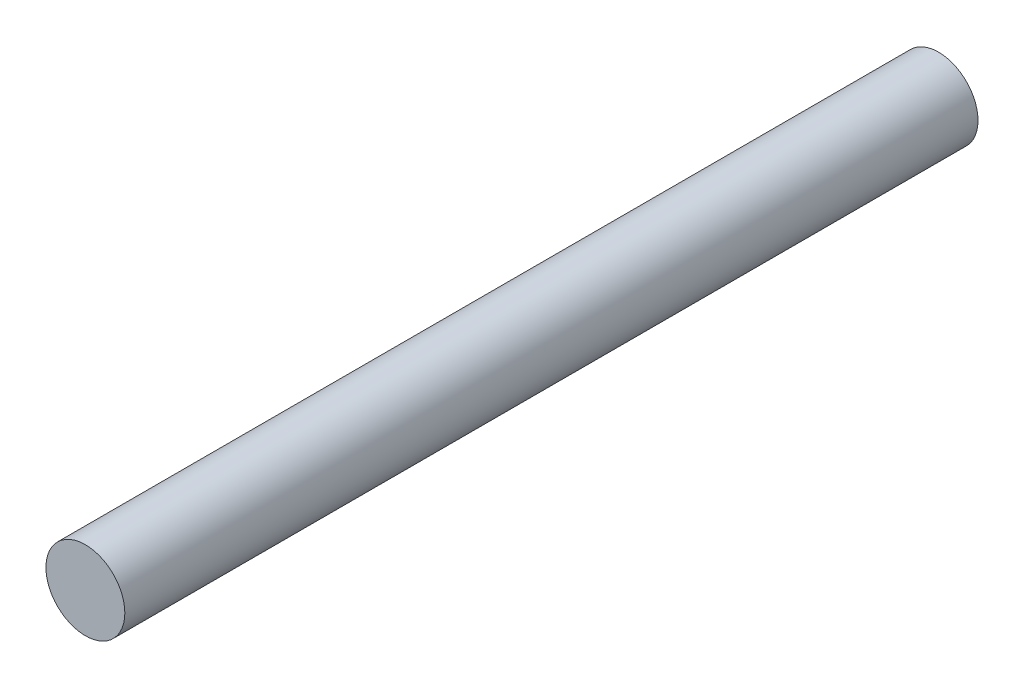
ISO-10303-21;
HEADER;
FILE_DESCRIPTION(('STEP AP214'),'2;1');
FILE_NAME('part.step','',(''),(''),'','','');
FILE_SCHEMA(('AUTOMOTIVE_DESIGN { 1 0 10303 214 1 1 1 1 }'));
ENDSEC;
DATA;
#1=APPLICATION_CONTEXT('core data for automotive mechanical design processes');
#2=APPLICATION_PROTOCOL_DEFINITION('international standard','automotive_design',2000,#1);
#3=PRODUCT_CONTEXT('',#1,'mechanical');
#4=PRODUCT('Part','Part','',(#3));
#5=PRODUCT_RELATED_PRODUCT_CATEGORY('part','',(#4));
#6=PRODUCT_DEFINITION_FORMATION('','',#4);
#7=PRODUCT_DEFINITION_CONTEXT('part definition',#1,'design');
#8=PRODUCT_DEFINITION('design','',#6,#7);
#9=PRODUCT_DEFINITION_SHAPE('','',#8);
#10=(LENGTH_UNIT() NAMED_UNIT(*) SI_UNIT(.MILLI.,.METRE.));
#11=(NAMED_UNIT(*) PLANE_ANGLE_UNIT() SI_UNIT($,.RADIAN.));
#12=(NAMED_UNIT(*) SI_UNIT($,.STERADIAN.) SOLID_ANGLE_UNIT());
#13=UNCERTAINTY_MEASURE_WITH_UNIT(LENGTH_MEASURE(1.E-05),#10,'distance_accuracy_value','');
#14=(GEOMETRIC_REPRESENTATION_CONTEXT(3) GLOBAL_UNCERTAINTY_ASSIGNED_CONTEXT((#13)) GLOBAL_UNIT_ASSIGNED_CONTEXT((#10,
#11,#12)) REPRESENTATION_CONTEXT('',''));
#15=CARTESIAN_POINT('',(0.,0.,0.));
#16=DIRECTION('',(0.,0.,1.));
#17=DIRECTION('',(1.,0.,0.));
#18=AXIS2_PLACEMENT_3D('',#15,#16,#17);
#19=CARTESIAN_POINT('',(0.,0.,100.));
#20=DIRECTION('',(0.,0.,-1.));
#21=DIRECTION('',(-1.,0.,0.));
#22=AXIS2_PLACEMENT_3D('',#19,#20,#21);
#23=CYLINDRICAL_SURFACE('',#22,4.62481396325382);
#24=CARTESIAN_POINT('',(0.,0.,100.));
#25=DIRECTION('',(0.,0.,1.));
#26=DIRECTION('',(1.,0.,0.));
#27=AXIS2_PLACEMENT_3D('',#24,#25,#26);
#28=CIRCLE('',#27,4.62481396325382);
#29=CARTESIAN_POINT('',(4.62481396325382,0.,100.));
#30=VERTEX_POINT('',#29);
#31=EDGE_CURVE('E10',#30,#30,#28,.T.);
#32=ORIENTED_EDGE('',*,*,#31,.F.);
#33=EDGE_LOOP('',(#32));
#34=FACE_BOUND('',#33,.T.);
#35=CARTESIAN_POINT('',(0.,0.,0.));
#36=DIRECTION('',(0.,0.,1.));
#37=DIRECTION('',(1.,0.,0.));
#38=AXIS2_PLACEMENT_3D('',#35,#36,#37);
#39=CIRCLE('',#38,4.62481396325382);
#40=CARTESIAN_POINT('',(4.62481396325382,0.,0.));
#41=VERTEX_POINT('',#40);
#42=EDGE_CURVE('E40',#41,#41,#39,.T.);
#43=ORIENTED_EDGE('',*,*,#42,.T.);
#44=EDGE_LOOP('',(#43));
#45=FACE_BOUND('',#44,.T.);
#46=ADVANCED_FACE('F37',(#34,#45),#23,.T.);
#47=CARTESIAN_POINT('',(0.,0.,100.));
#48=DIRECTION('',(0.,0.,1.));
#49=DIRECTION('',(1.,0.,0.));
#50=AXIS2_PLACEMENT_3D('',#47,#48,#49);
#51=PLANE('',#50);
#52=ORIENTED_EDGE('',*,*,#31,.T.);
#53=EDGE_LOOP('',(#52));
#54=FACE_BOUND('',#53,.T.);
#55=ADVANCED_FACE('F54',(#54),#51,.T.);
#56=CARTESIAN_POINT('',(0.,0.,0.));
#57=DIRECTION('',(0.,0.,1.));
#58=DIRECTION('',(1.,0.,0.));
#59=AXIS2_PLACEMENT_3D('',#56,#57,#58);
#60=PLANE('',#59);
#61=ORIENTED_EDGE('',*,*,#42,.F.);
#62=EDGE_LOOP('',(#61));
#63=FACE_BOUND('',#62,.T.);
#64=ADVANCED_FACE('F52',(#63),#60,.F.);
#65=CLOSED_SHELL('',(#46,#55,#64));
#66=MANIFOLD_SOLID_BREP('B2',#65);
#67=ADVANCED_BREP_SHAPE_REPRESENTATION('',(#18,#66),#14);
#68=SHAPE_DEFINITION_REPRESENTATION(#9,#67);
ENDSEC;
END-ISO-10303-21;
